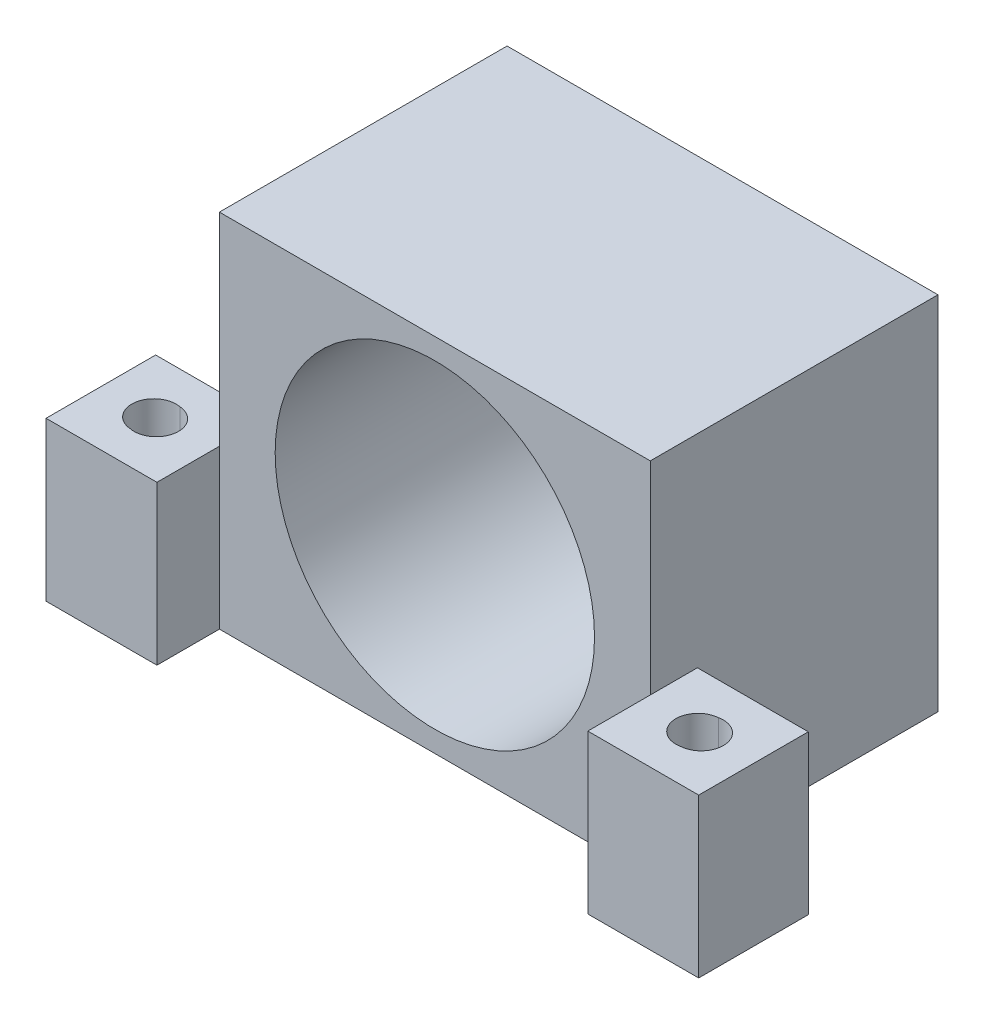
ISO-10303-21;
HEADER;
FILE_DESCRIPTION(('STEP AP214'),'2;1');
FILE_NAME('part.step','',(''),(''),'','','');
FILE_SCHEMA(('AUTOMOTIVE_DESIGN { 1 0 10303 214 1 1 1 1 }'));
ENDSEC;
DATA;
#1=APPLICATION_CONTEXT('core data for automotive mechanical design processes');
#2=APPLICATION_PROTOCOL_DEFINITION('international standard','automotive_design',2000,#1);
#3=PRODUCT_CONTEXT('',#1,'mechanical');
#4=PRODUCT('Part','Part','',(#3));
#5=PRODUCT_RELATED_PRODUCT_CATEGORY('part','',(#4));
#6=PRODUCT_DEFINITION_FORMATION('','',#4);
#7=PRODUCT_DEFINITION_CONTEXT('part definition',#1,'design');
#8=PRODUCT_DEFINITION('design','',#6,#7);
#9=PRODUCT_DEFINITION_SHAPE('','',#8);
#10=(LENGTH_UNIT() NAMED_UNIT(*) SI_UNIT(.MILLI.,.METRE.));
#11=(NAMED_UNIT(*) PLANE_ANGLE_UNIT() SI_UNIT($,.RADIAN.));
#12=(NAMED_UNIT(*) SI_UNIT($,.STERADIAN.) SOLID_ANGLE_UNIT());
#13=UNCERTAINTY_MEASURE_WITH_UNIT(LENGTH_MEASURE(1.E-05),#10,'distance_accuracy_value','');
#14=(GEOMETRIC_REPRESENTATION_CONTEXT(3) GLOBAL_UNCERTAINTY_ASSIGNED_CONTEXT((#13)) GLOBAL_UNIT_ASSIGNED_CONTEXT((#10,
#11,#12)) REPRESENTATION_CONTEXT('',''));
#15=CARTESIAN_POINT('',(0.,0.,0.));
#16=DIRECTION('',(0.,0.,1.));
#17=DIRECTION('',(1.,0.,0.));
#18=AXIS2_PLACEMENT_3D('',#15,#16,#17);
#19=CARTESIAN_POINT('',(21.375,-14.25,23.305));
#20=DIRECTION('',(0.,1.,0.));
#21=DIRECTION('',(-1.,0.,0.));
#22=AXIS2_PLACEMENT_3D('',#19,#20,#21);
#23=CYLINDRICAL_SURFACE('',#22,1.75);
#24=CARTESIAN_POINT('',(21.375,-11.075,23.305));
#25=DIRECTION('',(0.,-1.,0.));
#26=DIRECTION('',(1.,0.,0.));
#27=AXIS2_PLACEMENT_3D('',#24,#25,#26);
#28=CIRCLE('',#27,1.75);
#29=CARTESIAN_POINT('',(21.2411225701097,-11.075,21.5601284191191));
#30=VERTEX_POINT('',#29);
#31=CARTESIAN_POINT('',(21.7238774298904,-11.075,25.0198715808809));
#32=VERTEX_POINT('',#31);
#33=EDGE_CURVE('E175',#30,#32,#28,.F.);
#34=ORIENTED_EDGE('',*,*,#33,.F.);
#35=DIRECTION('',(0.,1.,0.));
#36=VECTOR('',#35,1.);
#37=CARTESIAN_POINT('',(21.2411225701097,-23.75,21.5601284191191));
#38=LINE('',#37,#36);
#39=CARTESIAN_POINT('',(21.2411225701097,-1.75,21.5601284191191));
#40=VERTEX_POINT('',#39);
#41=EDGE_CURVE('E55',#30,#40,#38,.T.);
#42=ORIENTED_EDGE('',*,*,#41,.T.);
#43=CARTESIAN_POINT('',(21.375,-1.75,23.305));
#44=DIRECTION('',(0.,1.,0.));
#45=DIRECTION('',(-1.,0.,0.));
#46=AXIS2_PLACEMENT_3D('',#43,#44,#45);
#47=CIRCLE('',#46,1.75);
#48=CARTESIAN_POINT('',(21.7238774298904,-1.75,25.0198715808809));
#49=VERTEX_POINT('',#48);
#50=EDGE_CURVE('E166',#40,#49,#47,.T.);
#51=ORIENTED_EDGE('',*,*,#50,.T.);
#52=DIRECTION('',(0.,1.,0.));
#53=VECTOR('',#52,1.);
#54=CARTESIAN_POINT('',(21.7238774298904,-23.75,25.0198715808809));
#55=LINE('',#54,#53);
#56=EDGE_CURVE('E343',#49,#32,#55,.F.);
#57=ORIENTED_EDGE('',*,*,#56,.T.);
#58=EDGE_LOOP('',(#34,#42,#51,#57));
#59=FACE_BOUND('',#58,.T.);
#60=ADVANCED_FACE('F33',(#59),#23,.F.);
#61=CARTESIAN_POINT('',(-21.375,-14.25,23.305));
#62=DIRECTION('',(0.,1.,0.));
#63=DIRECTION('',(-1.,0.,0.));
#64=AXIS2_PLACEMENT_3D('',#61,#62,#63);
#65=CYLINDRICAL_SURFACE('',#64,1.75);
#66=CARTESIAN_POINT('',(-21.375,-11.075,23.305));
#67=DIRECTION('',(0.,-1.,0.));
#68=DIRECTION('',(1.,0.,0.));
#69=AXIS2_PLACEMENT_3D('',#66,#67,#68);
#70=CIRCLE('',#69,1.75);
#71=CARTESIAN_POINT('',(-21.7238774298903,-11.075,25.019871580881));
#72=VERTEX_POINT('',#71);
#73=CARTESIAN_POINT('',(-21.2411225701095,-11.075,21.5601284191191));
#74=VERTEX_POINT('',#73);
#75=EDGE_CURVE('E158',#72,#74,#70,.F.);
#76=ORIENTED_EDGE('',*,*,#75,.F.);
#77=DIRECTION('',(0.,1.,0.));
#78=VECTOR('',#77,1.);
#79=CARTESIAN_POINT('',(-21.7238774298903,-23.75,25.019871580881));
#80=LINE('',#79,#78);
#81=CARTESIAN_POINT('',(-21.7238774298903,-1.75,25.019871580881));
#82=VERTEX_POINT('',#81);
#83=EDGE_CURVE('E47',#72,#82,#80,.T.);
#84=ORIENTED_EDGE('',*,*,#83,.T.);
#85=CARTESIAN_POINT('',(-21.375,-1.75,23.305));
#86=DIRECTION('',(0.,1.,0.));
#87=DIRECTION('',(-1.,0.,0.));
#88=AXIS2_PLACEMENT_3D('',#85,#86,#87);
#89=CIRCLE('',#88,1.75);
#90=CARTESIAN_POINT('',(-21.2411225701095,-1.75,21.5601284191191));
#91=VERTEX_POINT('',#90);
#92=EDGE_CURVE('E160',#82,#91,#89,.T.);
#93=ORIENTED_EDGE('',*,*,#92,.T.);
#94=DIRECTION('',(0.,1.,0.));
#95=VECTOR('',#94,1.);
#96=CARTESIAN_POINT('',(-21.2411225701095,-23.75,21.5601284191191));
#97=LINE('',#96,#95);
#98=EDGE_CURVE('E150',#91,#74,#97,.F.);
#99=ORIENTED_EDGE('',*,*,#98,.T.);
#100=EDGE_LOOP('',(#76,#84,#93,#99));
#101=FACE_BOUND('',#100,.T.);
#102=ADVANCED_FACE('F157',(#101),#65,.F.);
#103=CARTESIAN_POINT('',(17.,14.25,22.7));
#104=DIRECTION('',(-1.,0.,0.));
#105=DIRECTION('',(0.,0.,1.));
#106=AXIS2_PLACEMENT_3D('',#103,#104,#105);
#107=PLANE('',#106);
#108=DIRECTION('',(0.,0.,1.));
#109=VECTOR('',#108,1.);
#110=CARTESIAN_POINT('',(17.,-1.75,18.98));
#111=LINE('',#110,#109);
#112=CARTESIAN_POINT('',(17.,-1.75,18.98));
#113=VERTEX_POINT('',#112);
#114=CARTESIAN_POINT('',(17.,-1.75,22.7));
#115=VERTEX_POINT('',#114);
#116=EDGE_CURVE('E289',#113,#115,#111,.T.);
#117=ORIENTED_EDGE('',*,*,#116,.F.);
#118=DIRECTION('',(0.,-1.,0.));
#119=VECTOR('',#118,1.);
#120=CARTESIAN_POINT('',(17.,-1.75,18.98));
#121=LINE('',#120,#119);
#122=CARTESIAN_POINT('',(17.,-14.25,18.98));
#123=VERTEX_POINT('',#122);
#124=EDGE_CURVE('E308',#113,#123,#121,.T.);
#125=ORIENTED_EDGE('',*,*,#124,.T.);
#126=DIRECTION('',(0.,0.,-1.));
#127=VECTOR('',#126,1.);
#128=CARTESIAN_POINT('',(17.,-14.25,22.7));
#129=LINE('',#128,#127);
#130=CARTESIAN_POINT('',(17.,-14.25,0.));
#131=VERTEX_POINT('',#130);
#132=EDGE_CURVE('E194',#123,#131,#129,.T.);
#133=ORIENTED_EDGE('',*,*,#132,.T.);
#134=DIRECTION('',(0.,1.,0.));
#135=VECTOR('',#134,1.);
#136=CARTESIAN_POINT('',(17.,14.25,0.));
#137=LINE('',#136,#135);
#138=CARTESIAN_POINT('',(17.,14.25,0.));
#139=VERTEX_POINT('',#138);
#140=EDGE_CURVE('E214',#131,#139,#137,.T.);
#141=ORIENTED_EDGE('',*,*,#140,.T.);
#142=DIRECTION('',(0.,0.,-1.));
#143=VECTOR('',#142,1.);
#144=CARTESIAN_POINT('',(17.,14.25,22.7));
#145=LINE('',#144,#143);
#146=CARTESIAN_POINT('',(17.,14.25,22.7));
#147=VERTEX_POINT('',#146);
#148=EDGE_CURVE('E200',#147,#139,#145,.T.);
#149=ORIENTED_EDGE('',*,*,#148,.F.);
#150=DIRECTION('',(0.,1.,0.));
#151=VECTOR('',#150,1.);
#152=CARTESIAN_POINT('',(17.,14.25,22.7));
#153=LINE('',#152,#151);
#154=EDGE_CURVE('E226',#115,#147,#153,.T.);
#155=ORIENTED_EDGE('',*,*,#154,.F.);
#156=EDGE_LOOP('',(#117,#125,#133,#141,#149,#155));
#157=FACE_BOUND('',#156,.T.);
#158=ADVANCED_FACE('F391',(#157),#107,.F.);
#159=CARTESIAN_POINT('',(-17.,14.25,22.7));
#160=DIRECTION('',(1.,0.,0.));
#161=DIRECTION('',(0.,0.,-1.));
#162=AXIS2_PLACEMENT_3D('',#159,#160,#161);
#163=PLANE('',#162);
#164=DIRECTION('',(0.,1.,0.));
#165=VECTOR('',#164,1.);
#166=CARTESIAN_POINT('',(-17.,-1.75,18.98));
#167=LINE('',#166,#165);
#168=CARTESIAN_POINT('',(-17.,-14.25,18.98));
#169=VERTEX_POINT('',#168);
#170=CARTESIAN_POINT('',(-17.,-1.75,18.98));
#171=VERTEX_POINT('',#170);
#172=EDGE_CURVE('E274',#169,#171,#167,.T.);
#173=ORIENTED_EDGE('',*,*,#172,.T.);
#174=DIRECTION('',(0.,0.,1.));
#175=VECTOR('',#174,1.);
#176=CARTESIAN_POINT('',(-17.,-1.75,18.98));
#177=LINE('',#176,#175);
#178=CARTESIAN_POINT('',(-17.,-1.75,22.7));
#179=VERTEX_POINT('',#178);
#180=EDGE_CURVE('E257',#171,#179,#177,.T.);
#181=ORIENTED_EDGE('',*,*,#180,.T.);
#182=DIRECTION('',(0.,-1.,0.));
#183=VECTOR('',#182,1.);
#184=CARTESIAN_POINT('',(-17.,14.25,22.7));
#185=LINE('',#184,#183);
#186=CARTESIAN_POINT('',(-17.,14.25,22.7));
#187=VERTEX_POINT('',#186);
#188=EDGE_CURVE('E230',#187,#179,#185,.T.);
#189=ORIENTED_EDGE('',*,*,#188,.F.);
#190=DIRECTION('',(0.,0.,-1.));
#191=VECTOR('',#190,1.);
#192=CARTESIAN_POINT('',(-17.,14.25,22.7));
#193=LINE('',#192,#191);
#194=CARTESIAN_POINT('',(-17.,14.25,0.));
#195=VERTEX_POINT('',#194);
#196=EDGE_CURVE('E205',#187,#195,#193,.T.);
#197=ORIENTED_EDGE('',*,*,#196,.T.);
#198=DIRECTION('',(0.,-1.,0.));
#199=VECTOR('',#198,1.);
#200=CARTESIAN_POINT('',(-17.,14.25,0.));
#201=LINE('',#200,#199);
#202=CARTESIAN_POINT('',(-17.,-14.25,0.));
#203=VERTEX_POINT('',#202);
#204=EDGE_CURVE('E218',#195,#203,#201,.T.);
#205=ORIENTED_EDGE('',*,*,#204,.T.);
#206=DIRECTION('',(0.,0.,-1.));
#207=VECTOR('',#206,1.);
#208=CARTESIAN_POINT('',(-17.,-14.25,22.7));
#209=LINE('',#208,#207);
#210=EDGE_CURVE('E173',#169,#203,#209,.T.);
#211=ORIENTED_EDGE('',*,*,#210,.F.);
#212=EDGE_LOOP('',(#173,#181,#189,#197,#205,#211));
#213=FACE_BOUND('',#212,.T.);
#214=ADVANCED_FACE('F35',(#213),#163,.F.);
#215=CARTESIAN_POINT('',(17.,-14.25,22.7));
#216=DIRECTION('',(0.,1.,0.));
#217=DIRECTION('',(0.,0.,1.));
#218=AXIS2_PLACEMENT_3D('',#215,#216,#217);
#219=PLANE('',#218);
#220=CARTESIAN_POINT('',(21.375,-14.25,23.305));
#221=DIRECTION('',(0.,-1.,0.));
#222=DIRECTION('',(1.,0.,0.));
#223=AXIS2_PLACEMENT_3D('',#220,#221,#222);
#224=CIRCLE('',#223,3.25);
#225=CARTESIAN_POINT('',(24.625,-14.25,23.305));
#226=VERTEX_POINT('',#225);
#227=EDGE_CURVE('E182',#226,#226,#224,.T.);
#228=ORIENTED_EDGE('',*,*,#227,.F.);
#229=EDGE_LOOP('',(#228));
#230=FACE_BOUND('',#229,.T.);
#231=CARTESIAN_POINT('',(-21.375,-14.25,23.305));
#232=DIRECTION('',(0.,-1.,0.));
#233=DIRECTION('',(1.,0.,0.));
#234=AXIS2_PLACEMENT_3D('',#231,#232,#233);
#235=CIRCLE('',#234,3.25);
#236=CARTESIAN_POINT('',(-18.125,-14.25,23.305));
#237=VERTEX_POINT('',#236);
#238=EDGE_CURVE('E169',#237,#237,#235,.T.);
#239=ORIENTED_EDGE('',*,*,#238,.F.);
#240=EDGE_LOOP('',(#239));
#241=FACE_BOUND('',#240,.T.);
#242=DIRECTION('',(1.,0.,0.));
#243=VECTOR('',#242,1.);
#244=CARTESIAN_POINT('',(17.,-14.25,0.));
#245=LINE('',#244,#243);
#246=EDGE_CURVE('E216',#203,#131,#245,.T.);
#247=ORIENTED_EDGE('',*,*,#246,.T.);
#248=ORIENTED_EDGE('',*,*,#132,.F.);
#249=DIRECTION('',(1.,0.,0.));
#250=VECTOR('',#249,1.);
#251=CARTESIAN_POINT('',(17.,-14.25,18.98));
#252=LINE('',#251,#250);
#253=CARTESIAN_POINT('',(25.75,-14.25,18.98));
#254=VERTEX_POINT('',#253);
#255=EDGE_CURVE('E305',#123,#254,#252,.T.);
#256=ORIENTED_EDGE('',*,*,#255,.T.);
#257=DIRECTION('',(0.,0.,1.));
#258=VECTOR('',#257,1.);
#259=CARTESIAN_POINT('',(25.75,-14.25,18.98));
#260=LINE('',#259,#258);
#261=CARTESIAN_POINT('',(25.75,-14.25,27.63));
#262=VERTEX_POINT('',#261);
#263=EDGE_CURVE('E292',#254,#262,#260,.T.);
#264=ORIENTED_EDGE('',*,*,#263,.T.);
#265=DIRECTION('',(1.,0.,0.));
#266=VECTOR('',#265,1.);
#267=CARTESIAN_POINT('',(17.,-14.25,27.63));
#268=LINE('',#267,#266);
#269=CARTESIAN_POINT('',(17.,-14.25,27.63));
#270=VERTEX_POINT('',#269);
#271=EDGE_CURVE('E316',#270,#262,#268,.T.);
#272=ORIENTED_EDGE('',*,*,#271,.F.);
#273=DIRECTION('',(0.,0.,1.));
#274=VECTOR('',#273,1.);
#275=CARTESIAN_POINT('',(17.,-14.25,18.98));
#276=LINE('',#275,#274);
#277=CARTESIAN_POINT('',(17.,-14.25,22.7));
#278=VERTEX_POINT('',#277);
#279=EDGE_CURVE('E290',#278,#270,#276,.T.);
#280=ORIENTED_EDGE('',*,*,#279,.F.);
#281=DIRECTION('',(1.,0.,0.));
#282=VECTOR('',#281,1.);
#283=CARTESIAN_POINT('',(17.,-14.25,22.7));
#284=LINE('',#283,#282);
#285=CARTESIAN_POINT('',(-17.,-14.25,22.7));
#286=VERTEX_POINT('',#285);
#287=EDGE_CURVE('E227',#286,#278,#284,.T.);
#288=ORIENTED_EDGE('',*,*,#287,.F.);
#289=DIRECTION('',(0.,0.,1.));
#290=VECTOR('',#289,1.);
#291=CARTESIAN_POINT('',(-17.,-14.25,18.98));
#292=LINE('',#291,#290);
#293=CARTESIAN_POINT('',(-17.,-14.25,27.63));
#294=VERTEX_POINT('',#293);
#295=EDGE_CURVE('E252',#286,#294,#292,.T.);
#296=ORIENTED_EDGE('',*,*,#295,.T.);
#297=DIRECTION('',(1.,0.,0.));
#298=VECTOR('',#297,1.);
#299=CARTESIAN_POINT('',(-17.,-14.25,27.63));
#300=LINE('',#299,#298);
#301=CARTESIAN_POINT('',(-25.75,-14.25,27.63));
#302=VERTEX_POINT('',#301);
#303=EDGE_CURVE('E277',#302,#294,#300,.T.);
#304=ORIENTED_EDGE('',*,*,#303,.F.);
#305=DIRECTION('',(0.,0.,1.));
#306=VECTOR('',#305,1.);
#307=CARTESIAN_POINT('',(-25.75,-14.25,18.98));
#308=LINE('',#307,#306);
#309=CARTESIAN_POINT('',(-25.75,-14.25,18.98));
#310=VERTEX_POINT('',#309);
#311=EDGE_CURVE('E263',#310,#302,#308,.T.);
#312=ORIENTED_EDGE('',*,*,#311,.F.);
#313=DIRECTION('',(1.,0.,0.));
#314=VECTOR('',#313,1.);
#315=CARTESIAN_POINT('',(-17.,-14.25,18.98));
#316=LINE('',#315,#314);
#317=EDGE_CURVE('E266',#310,#169,#316,.T.);
#318=ORIENTED_EDGE('',*,*,#317,.T.);
#319=ORIENTED_EDGE('',*,*,#210,.T.);
#320=EDGE_LOOP('',(#247,#248,#256,#264,#272,#280,#288,#296,#304,#312,#318,#319));
#321=FACE_BOUND('',#320,.T.);
#322=ADVANCED_FACE('F365',(#230,#241,#321),#219,.F.);
#323=CARTESIAN_POINT('',(-17.,14.25,22.7));
#324=DIRECTION('',(0.,-1.,0.));
#325=DIRECTION('',(0.,0.,-1.));
#326=AXIS2_PLACEMENT_3D('',#323,#324,#325);
#327=PLANE('',#326);
#328=DIRECTION('',(-1.,0.,0.));
#329=VECTOR('',#328,1.);
#330=CARTESIAN_POINT('',(-17.,14.25,0.));
#331=LINE('',#330,#329);
#332=EDGE_CURVE('E211',#139,#195,#331,.T.);
#333=ORIENTED_EDGE('',*,*,#332,.T.);
#334=ORIENTED_EDGE('',*,*,#196,.F.);
#335=DIRECTION('',(-1.,0.,0.));
#336=VECTOR('',#335,1.);
#337=CARTESIAN_POINT('',(-17.,14.25,22.7));
#338=LINE('',#337,#336);
#339=EDGE_CURVE('E210',#147,#187,#338,.T.);
#340=ORIENTED_EDGE('',*,*,#339,.F.);
#341=ORIENTED_EDGE('',*,*,#148,.T.);
#342=EDGE_LOOP('',(#333,#334,#340,#341));
#343=FACE_BOUND('',#342,.T.);
#344=ADVANCED_FACE('F379',(#343),#327,.F.);
#345=CARTESIAN_POINT('',(0.,0.,22.7));
#346=DIRECTION('',(0.,0.,-1.));
#347=DIRECTION('',(-1.,0.,0.));
#348=AXIS2_PLACEMENT_3D('',#345,#346,#347);
#349=PLANE('',#348);
#350=CARTESIAN_POINT('',(0.,0.,22.7));
#351=DIRECTION('',(0.,0.,1.));
#352=DIRECTION('',(1.,0.,0.));
#353=AXIS2_PLACEMENT_3D('',#350,#351,#352);
#354=CIRCLE('',#353,12.6);
#355=CARTESIAN_POINT('',(12.6,0.,22.7));
#356=VERTEX_POINT('',#355);
#357=EDGE_CURVE('E233',#356,#356,#354,.T.);
#358=ORIENTED_EDGE('',*,*,#357,.F.);
#359=EDGE_LOOP('',(#358));
#360=FACE_BOUND('',#359,.T.);
#361=ORIENTED_EDGE('',*,*,#188,.T.);
#362=EDGE_CURVE('E213',#179,#286,#185,.T.);
#363=ORIENTED_EDGE('',*,*,#362,.T.);
#364=ORIENTED_EDGE('',*,*,#287,.T.);
#365=EDGE_CURVE('E223',#278,#115,#153,.T.);
#366=ORIENTED_EDGE('',*,*,#365,.T.);
#367=ORIENTED_EDGE('',*,*,#154,.T.);
#368=ORIENTED_EDGE('',*,*,#339,.T.);
#369=EDGE_LOOP('',(#361,#363,#364,#366,#367,#368));
#370=FACE_BOUND('',#369,.T.);
#371=ADVANCED_FACE('F373',(#360,#370),#349,.F.);
#372=CARTESIAN_POINT('',(0.,0.,0.));
#373=DIRECTION('',(0.,0.,-1.));
#374=DIRECTION('',(-1.,0.,0.));
#375=AXIS2_PLACEMENT_3D('',#372,#373,#374);
#376=PLANE('',#375);
#377=CARTESIAN_POINT('',(-6.01040764008568,6.01040764008562,0.));
#378=DIRECTION('',(0.,0.,-1.));
#379=DIRECTION('',(-1.,0.,0.));
#380=AXIS2_PLACEMENT_3D('',#377,#378,#379);
#381=CIRCLE('',#380,2.8);
#382=CARTESIAN_POINT('',(-8.81040764008569,6.01040764008562,0.));
#383=VERTEX_POINT('',#382);
#384=EDGE_CURVE('E188',#383,#383,#381,.T.);
#385=ORIENTED_EDGE('',*,*,#384,.F.);
#386=EDGE_LOOP('',(#385));
#387=FACE_BOUND('',#386,.T.);
#388=CARTESIAN_POINT('',(6.01040764008569,-6.01040764008562,0.));
#389=DIRECTION('',(0.,0.,-1.));
#390=DIRECTION('',(-1.,0.,0.));
#391=AXIS2_PLACEMENT_3D('',#388,#389,#390);
#392=CIRCLE('',#391,2.8);
#393=CARTESIAN_POINT('',(3.21040764008569,-6.01040764008562,0.));
#394=VERTEX_POINT('',#393);
#395=EDGE_CURVE('E335',#394,#394,#392,.T.);
#396=ORIENTED_EDGE('',*,*,#395,.F.);
#397=EDGE_LOOP('',(#396));
#398=FACE_BOUND('',#397,.T.);
#399=CARTESIAN_POINT('',(6.01040764008564,6.01040764008567,0.));
#400=DIRECTION('',(0.,0.,-1.));
#401=DIRECTION('',(-1.,0.,0.));
#402=AXIS2_PLACEMENT_3D('',#399,#400,#401);
#403=CIRCLE('',#402,2.8);
#404=CARTESIAN_POINT('',(3.21040764008564,6.01040764008567,0.));
#405=VERTEX_POINT('',#404);
#406=EDGE_CURVE('E332',#405,#405,#403,.T.);
#407=ORIENTED_EDGE('',*,*,#406,.F.);
#408=EDGE_LOOP('',(#407));
#409=FACE_BOUND('',#408,.T.);
#410=CARTESIAN_POINT('',(-6.01040764008564,-6.01040764008566,0.));
#411=DIRECTION('',(0.,0.,-1.));
#412=DIRECTION('',(-1.,0.,0.));
#413=AXIS2_PLACEMENT_3D('',#410,#411,#412);
#414=CIRCLE('',#413,2.8);
#415=CARTESIAN_POINT('',(-8.81040764008564,-6.01040764008566,0.));
#416=VERTEX_POINT('',#415);
#417=EDGE_CURVE('E183',#416,#416,#414,.T.);
#418=ORIENTED_EDGE('',*,*,#417,.F.);
#419=EDGE_LOOP('',(#418));
#420=FACE_BOUND('',#419,.T.);
#421=CARTESIAN_POINT('',(0.,0.,0.));
#422=DIRECTION('',(0.,0.,1.));
#423=DIRECTION('',(1.,0.,0.));
#424=AXIS2_PLACEMENT_3D('',#421,#422,#423);
#425=CIRCLE('',#424,3.75);
#426=CARTESIAN_POINT('',(3.75,0.,0.));
#427=VERTEX_POINT('',#426);
#428=EDGE_CURVE('E251',#427,#427,#425,.T.);
#429=ORIENTED_EDGE('',*,*,#428,.T.);
#430=EDGE_LOOP('',(#429));
#431=FACE_BOUND('',#430,.T.);
#432=ORIENTED_EDGE('',*,*,#204,.F.);
#433=ORIENTED_EDGE('',*,*,#332,.F.);
#434=ORIENTED_EDGE('',*,*,#140,.F.);
#435=ORIENTED_EDGE('',*,*,#246,.F.);
#436=EDGE_LOOP('',(#432,#433,#434,#435));
#437=FACE_BOUND('',#436,.T.);
#438=ADVANCED_FACE('F383',(#387,#398,#409,#420,#431,#437),#376,.T.);
#439=CARTESIAN_POINT('',(0.,0.,1.7));
#440=DIRECTION('',(0.,0.,1.));
#441=DIRECTION('',(1.,0.,0.));
#442=AXIS2_PLACEMENT_3D('',#439,#440,#441);
#443=CYLINDRICAL_SURFACE('',#442,12.6);
#444=CARTESIAN_POINT('',(0.,0.,1.7));
#445=DIRECTION('',(0.,0.,1.));
#446=DIRECTION('',(1.,0.,0.));
#447=AXIS2_PLACEMENT_3D('',#444,#445,#446);
#448=CIRCLE('',#447,12.6);
#449=CARTESIAN_POINT('',(12.6,0.,1.7));
#450=VERTEX_POINT('',#449);
#451=EDGE_CURVE('E221',#450,#450,#448,.T.);
#452=CARTESIAN_POINT('',(12.6,0.,1.7));
#453=CARTESIAN_POINT('',(12.6,0.,1.91875));
#454=CARTESIAN_POINT('',(12.6,0.,2.1375));
#455=CARTESIAN_POINT('',(12.6,0.,2.575));
#456=CARTESIAN_POINT('',(12.6,0.,2.79375));
#457=CARTESIAN_POINT('',(12.6,0.,3.23125));
#458=CARTESIAN_POINT('',(12.6,0.,3.45));
#459=CARTESIAN_POINT('',(12.6,0.,3.8875));
#460=CARTESIAN_POINT('',(12.6,0.,4.10625));
#461=CARTESIAN_POINT('',(12.6,0.,4.54375));
#462=CARTESIAN_POINT('',(12.6,0.,4.7625));
#463=CARTESIAN_POINT('',(12.6,0.,5.2));
#464=CARTESIAN_POINT('',(12.6,0.,5.41875));
#465=CARTESIAN_POINT('',(12.6,0.,5.85625));
#466=CARTESIAN_POINT('',(12.6,0.,6.075));
#467=CARTESIAN_POINT('',(12.6,0.,6.5125));
#468=CARTESIAN_POINT('',(12.6,0.,6.73125));
#469=CARTESIAN_POINT('',(12.6,0.,7.16875));
#470=CARTESIAN_POINT('',(12.6,0.,7.3875));
#471=CARTESIAN_POINT('',(12.6,0.,7.825));
#472=CARTESIAN_POINT('',(12.6,0.,8.04375));
#473=CARTESIAN_POINT('',(12.6,0.,8.48125));
#474=CARTESIAN_POINT('',(12.6,0.,8.7));
#475=CARTESIAN_POINT('',(12.6,0.,9.1375));
#476=CARTESIAN_POINT('',(12.6,0.,9.35625));
#477=CARTESIAN_POINT('',(12.6,0.,9.79375));
#478=CARTESIAN_POINT('',(12.6,0.,10.0125));
#479=CARTESIAN_POINT('',(12.6,0.,10.45));
#480=CARTESIAN_POINT('',(12.6,0.,10.66875));
#481=CARTESIAN_POINT('',(12.6,0.,11.10625));
#482=CARTESIAN_POINT('',(12.6,0.,11.325));
#483=CARTESIAN_POINT('',(12.6,0.,11.7625));
#484=CARTESIAN_POINT('',(12.6,0.,11.98125));
#485=CARTESIAN_POINT('',(12.6,0.,12.41875));
#486=CARTESIAN_POINT('',(12.6,0.,12.6375));
#487=CARTESIAN_POINT('',(12.6,0.,13.075));
#488=CARTESIAN_POINT('',(12.6,0.,13.29375));
#489=CARTESIAN_POINT('',(12.6,0.,13.73125));
#490=CARTESIAN_POINT('',(12.6,0.,13.95));
#491=CARTESIAN_POINT('',(12.6,0.,14.3875));
#492=CARTESIAN_POINT('',(12.6,0.,14.60625));
#493=CARTESIAN_POINT('',(12.6,0.,15.04375));
#494=CARTESIAN_POINT('',(12.6,0.,15.2625));
#495=CARTESIAN_POINT('',(12.6,0.,15.7));
#496=CARTESIAN_POINT('',(12.6,0.,15.91875));
#497=CARTESIAN_POINT('',(12.6,0.,16.35625));
#498=CARTESIAN_POINT('',(12.6,0.,16.575));
#499=CARTESIAN_POINT('',(12.6,0.,17.0125));
#500=CARTESIAN_POINT('',(12.6,0.,17.23125));
#501=CARTESIAN_POINT('',(12.6,0.,17.66875));
#502=CARTESIAN_POINT('',(12.6,0.,17.8875));
#503=CARTESIAN_POINT('',(12.6,0.,18.325));
#504=CARTESIAN_POINT('',(12.6,0.,18.54375));
#505=CARTESIAN_POINT('',(12.6,0.,18.98125));
#506=CARTESIAN_POINT('',(12.6,0.,19.2));
#507=CARTESIAN_POINT('',(12.6,0.,19.6375));
#508=CARTESIAN_POINT('',(12.6,0.,19.85625));
#509=CARTESIAN_POINT('',(12.6,0.,20.29375));
#510=CARTESIAN_POINT('',(12.6,0.,20.5125));
#511=CARTESIAN_POINT('',(12.6,0.,20.95));
#512=CARTESIAN_POINT('',(12.6,0.,21.16875));
#513=CARTESIAN_POINT('',(12.6,0.,21.60625));
#514=CARTESIAN_POINT('',(12.6,0.,21.825));
#515=CARTESIAN_POINT('',(12.6,0.,22.2625));
#516=CARTESIAN_POINT('',(12.6,0.,22.48125));
#517=CARTESIAN_POINT('',(12.6,0.,22.7));
#518=B_SPLINE_CURVE_WITH_KNOTS('',3,(#452,#453,#454,#455,#456,#457,#458,#459,#460,#461,#462,
#463,#464,#465,#466,#467,#468,#469,#470,#471,#472,#473,#474,#475,#476,#477,#478,#479,#480,#481,
#482,#483,#484,#485,#486,#487,#488,#489,#490,#491,#492,#493,#494,#495,#496,#497,#498,#499,#500,
#501,#502,#503,#504,#505,#506,#507,#508,#509,#510,#511,#512,#513,#514,#515,#516,#517),
.UNSPECIFIED.,.F.,.F.,(4,2,2,2,2,2,2,2,2,2,2,2,2,2,2,2,2,2,2,2,2,2,2,2,2,2,2,2,2,2,2,2,4),(0.,
0.65625,1.3125,1.96875,2.625,3.28125,3.9375,4.59375,5.25,5.90625,6.5625,7.21875,7.875,8.53125,
9.1875,9.84375,10.5,11.15625,11.8125,12.46875,13.125,13.78125,14.4375,15.09375,15.75,16.40625,
17.0625,17.71875,18.375,19.03125,19.6875,20.34375,21.),.UNSPECIFIED.);
#519=EDGE_CURVE('BSEAM628',#450,#356,#518,.T.);
#520=ORIENTED_EDGE('',*,*,#451,.F.);
#521=ORIENTED_EDGE('',*,*,#357,.T.);
#522=ORIENTED_EDGE('',*,*,#519,.T.);
#523=ORIENTED_EDGE('',*,*,#519,.F.);
#524=EDGE_LOOP('',(#520,#522,#521,#523));
#525=FACE_BOUND('',#524,.T.);
#526=ADVANCED_FACE('F628',(#525),#443,.F.);
#527=CARTESIAN_POINT('',(0.,0.,1.7));
#528=DIRECTION('',(0.,0.,1.));
#529=DIRECTION('',(1.,0.,0.));
#530=AXIS2_PLACEMENT_3D('',#527,#528,#529);
#531=PLANE('',#530);
#532=CARTESIAN_POINT('',(0.,0.,1.7));
#533=DIRECTION('',(0.,0.,1.));
#534=DIRECTION('',(1.,0.,0.));
#535=AXIS2_PLACEMENT_3D('',#532,#533,#534);
#536=CIRCLE('',#535,3.75);
#537=CARTESIAN_POINT('',(3.75,0.,1.7));
#538=VERTEX_POINT('',#537);
#539=EDGE_CURVE('E248',#538,#538,#536,.T.);
#540=ORIENTED_EDGE('',*,*,#539,.F.);
#541=EDGE_LOOP('',(#540));
#542=FACE_BOUND('',#541,.T.);
#543=CARTESIAN_POINT('',(-6.01040764008565,-6.01040764008566,1.7));
#544=DIRECTION('',(0.,0.,1.));
#545=DIRECTION('',(1.,0.,0.));
#546=AXIS2_PLACEMENT_3D('',#543,#544,#545);
#547=CIRCLE('',#546,1.625);
#548=CARTESIAN_POINT('',(-4.38540764008565,-6.01040764008566,1.7));
#549=VERTEX_POINT('',#548);
#550=EDGE_CURVE('E245',#549,#549,#547,.T.);
#551=ORIENTED_EDGE('',*,*,#550,.F.);
#552=EDGE_LOOP('',(#551));
#553=FACE_BOUND('',#552,.T.);
#554=CARTESIAN_POINT('',(6.01040764008566,-6.01040764008565,1.7));
#555=DIRECTION('',(0.,0.,1.));
#556=DIRECTION('',(1.,0.,0.));
#557=AXIS2_PLACEMENT_3D('',#554,#555,#556);
#558=CIRCLE('',#557,1.625);
#559=CARTESIAN_POINT('',(7.63540764008566,-6.01040764008565,1.7));
#560=VERTEX_POINT('',#559);
#561=EDGE_CURVE('E242',#560,#560,#558,.T.);
#562=ORIENTED_EDGE('',*,*,#561,.F.);
#563=EDGE_LOOP('',(#562));
#564=FACE_BOUND('',#563,.T.);
#565=CARTESIAN_POINT('',(-6.01040764008566,6.01040764008565,1.7));
#566=DIRECTION('',(0.,0.,1.));
#567=DIRECTION('',(1.,0.,0.));
#568=AXIS2_PLACEMENT_3D('',#565,#566,#567);
#569=CIRCLE('',#568,1.625);
#570=CARTESIAN_POINT('',(-4.38540764008566,6.01040764008565,1.7));
#571=VERTEX_POINT('',#570);
#572=EDGE_CURVE('E241',#571,#571,#569,.T.);
#573=ORIENTED_EDGE('',*,*,#572,.F.);
#574=EDGE_LOOP('',(#573));
#575=FACE_BOUND('',#574,.T.);
#576=CARTESIAN_POINT('',(6.01040764008565,6.01040764008566,1.7));
#577=DIRECTION('',(0.,0.,1.));
#578=DIRECTION('',(1.,0.,0.));
#579=AXIS2_PLACEMENT_3D('',#576,#577,#578);
#580=CIRCLE('',#579,1.625);
#581=CARTESIAN_POINT('',(7.63540764008565,6.01040764008566,1.7));
#582=VERTEX_POINT('',#581);
#583=EDGE_CURVE('E236',#582,#582,#580,.T.);
#584=ORIENTED_EDGE('',*,*,#583,.F.);
#585=EDGE_LOOP('',(#584));
#586=FACE_BOUND('',#585,.T.);
#587=ORIENTED_EDGE('',*,*,#451,.T.);
#588=EDGE_LOOP('',(#587));
#589=FACE_BOUND('',#588,.T.);
#590=ADVANCED_FACE('F636',(#542,#553,#564,#575,#586,#589),#531,.T.);
#591=CARTESIAN_POINT('',(6.01040764008565,6.01040764008566,0.));
#592=DIRECTION('',(0.,0.,1.));
#593=DIRECTION('',(1.,0.,0.));
#594=AXIS2_PLACEMENT_3D('',#591,#592,#593);
#595=CYLINDRICAL_SURFACE('',#594,1.625);
#596=CARTESIAN_POINT('',(6.01040764008564,6.01040764008567,1.175));
#597=DIRECTION('',(0.,0.,-1.));
#598=DIRECTION('',(-1.,0.,0.));
#599=AXIS2_PLACEMENT_3D('',#596,#597,#598);
#600=CIRCLE('',#599,1.625);
#601=CARTESIAN_POINT('',(4.38540764008564,6.01040764008567,1.175));
#602=VERTEX_POINT('',#601);
#603=EDGE_CURVE('E191',#602,#602,#600,.T.);
#604=ORIENTED_EDGE('',*,*,#603,.T.);
#605=EDGE_LOOP('',(#604));
#606=FACE_BOUND('',#605,.T.);
#607=ORIENTED_EDGE('',*,*,#583,.T.);
#608=EDGE_LOOP('',(#607));
#609=FACE_BOUND('',#608,.T.);
#610=ADVANCED_FACE('F644',(#606,#609),#595,.F.);
#611=CARTESIAN_POINT('',(-6.01040764008566,6.01040764008565,0.));
#612=DIRECTION('',(0.,0.,1.));
#613=DIRECTION('',(1.,0.,0.));
#614=AXIS2_PLACEMENT_3D('',#611,#612,#613);
#615=CYLINDRICAL_SURFACE('',#614,1.625);
#616=CARTESIAN_POINT('',(-6.01040764008568,6.01040764008562,1.175));
#617=DIRECTION('',(0.,0.,-1.));
#618=DIRECTION('',(-1.,0.,0.));
#619=AXIS2_PLACEMENT_3D('',#616,#617,#618);
#620=CIRCLE('',#619,1.625);
#621=CARTESIAN_POINT('',(-7.63540764008568,6.01040764008562,1.175));
#622=VERTEX_POINT('',#621);
#623=EDGE_CURVE('E187',#622,#622,#620,.T.);
#624=ORIENTED_EDGE('',*,*,#623,.T.);
#625=EDGE_LOOP('',(#624));
#626=FACE_BOUND('',#625,.T.);
#627=ORIENTED_EDGE('',*,*,#572,.T.);
#628=EDGE_LOOP('',(#627));
#629=FACE_BOUND('',#628,.T.);
#630=ADVANCED_FACE('F652',(#626,#629),#615,.F.);
#631=CARTESIAN_POINT('',(6.01040764008566,-6.01040764008565,0.));
#632=DIRECTION('',(0.,0.,1.));
#633=DIRECTION('',(1.,0.,0.));
#634=AXIS2_PLACEMENT_3D('',#631,#632,#633);
#635=CYLINDRICAL_SURFACE('',#634,1.625);
#636=CARTESIAN_POINT('',(6.01040764008569,-6.01040764008562,1.175));
#637=DIRECTION('',(0.,0.,-1.));
#638=DIRECTION('',(-1.,0.,0.));
#639=AXIS2_PLACEMENT_3D('',#636,#637,#638);
#640=CIRCLE('',#639,1.625);
#641=CARTESIAN_POINT('',(4.38540764008569,-6.01040764008562,1.175));
#642=VERTEX_POINT('',#641);
#643=EDGE_CURVE('E184',#642,#642,#640,.T.);
#644=ORIENTED_EDGE('',*,*,#643,.T.);
#645=EDGE_LOOP('',(#644));
#646=FACE_BOUND('',#645,.T.);
#647=ORIENTED_EDGE('',*,*,#561,.T.);
#648=EDGE_LOOP('',(#647));
#649=FACE_BOUND('',#648,.T.);
#650=ADVANCED_FACE('F660',(#646,#649),#635,.F.);
#651=CARTESIAN_POINT('',(-6.01040764008565,-6.01040764008566,0.));
#652=DIRECTION('',(0.,0.,1.));
#653=DIRECTION('',(1.,0.,0.));
#654=AXIS2_PLACEMENT_3D('',#651,#652,#653);
#655=CYLINDRICAL_SURFACE('',#654,1.625);
#656=CARTESIAN_POINT('',(-6.01040764008564,-6.01040764008566,1.175));
#657=DIRECTION('',(0.,0.,-1.));
#658=DIRECTION('',(-1.,0.,0.));
#659=AXIS2_PLACEMENT_3D('',#656,#657,#658);
#660=CIRCLE('',#659,1.625);
#661=CARTESIAN_POINT('',(-7.63540764008564,-6.01040764008566,1.175));
#662=VERTEX_POINT('',#661);
#663=EDGE_CURVE('E179',#662,#662,#660,.T.);
#664=ORIENTED_EDGE('',*,*,#663,.T.);
#665=EDGE_LOOP('',(#664));
#666=FACE_BOUND('',#665,.T.);
#667=ORIENTED_EDGE('',*,*,#550,.T.);
#668=EDGE_LOOP('',(#667));
#669=FACE_BOUND('',#668,.T.);
#670=ADVANCED_FACE('F668',(#666,#669),#655,.F.);
#671=CARTESIAN_POINT('',(0.,0.,0.));
#672=DIRECTION('',(0.,0.,1.));
#673=DIRECTION('',(1.,0.,0.));
#674=AXIS2_PLACEMENT_3D('',#671,#672,#673);
#675=CYLINDRICAL_SURFACE('',#674,3.75);
#676=ORIENTED_EDGE('',*,*,#428,.F.);
#677=EDGE_LOOP('',(#676));
#678=FACE_BOUND('',#677,.T.);
#679=ORIENTED_EDGE('',*,*,#539,.T.);
#680=EDGE_LOOP('',(#679));
#681=FACE_BOUND('',#680,.T.);
#682=ADVANCED_FACE('F593',(#678,#681),#675,.F.);
#683=CARTESIAN_POINT('',(-17.,-1.75,18.98));
#684=DIRECTION('',(1.,0.,0.));
#685=DIRECTION('',(0.,0.,-1.));
#686=AXIS2_PLACEMENT_3D('',#683,#684,#685);
#687=PLANE('',#686);
#688=ORIENTED_EDGE('',*,*,#362,.F.);
#689=CARTESIAN_POINT('',(-17.,-1.75,27.63));
#690=VERTEX_POINT('',#689);
#691=EDGE_CURVE('E261',#179,#690,#177,.T.);
#692=ORIENTED_EDGE('',*,*,#691,.T.);
#693=DIRECTION('',(0.,1.,0.));
#694=VECTOR('',#693,1.);
#695=CARTESIAN_POINT('',(-17.,-1.75,27.63));
#696=LINE('',#695,#694);
#697=EDGE_CURVE('E286',#294,#690,#696,.T.);
#698=ORIENTED_EDGE('',*,*,#697,.F.);
#699=ORIENTED_EDGE('',*,*,#295,.F.);
#700=EDGE_LOOP('',(#688,#692,#698,#699));
#701=FACE_BOUND('',#700,.T.);
#702=ADVANCED_FACE('F368',(#701),#687,.T.);
#703=CARTESIAN_POINT('',(-25.75,-1.75,18.98));
#704=DIRECTION('',(-1.,0.,0.));
#705=DIRECTION('',(0.,-1.,0.));
#706=AXIS2_PLACEMENT_3D('',#703,#704,#705);
#707=PLANE('',#706);
#708=ORIENTED_EDGE('',*,*,#311,.T.);
#709=DIRECTION('',(0.,-1.,0.));
#710=VECTOR('',#709,1.);
#711=CARTESIAN_POINT('',(-25.75,-1.75,27.63));
#712=LINE('',#711,#710);
#713=CARTESIAN_POINT('',(-25.75,-1.75,27.63));
#714=VERTEX_POINT('',#713);
#715=EDGE_CURVE('E280',#714,#302,#712,.T.);
#716=ORIENTED_EDGE('',*,*,#715,.F.);
#717=DIRECTION('',(0.,0.,1.));
#718=VECTOR('',#717,1.);
#719=CARTESIAN_POINT('',(-25.75,-1.75,18.98));
#720=LINE('',#719,#718);
#721=CARTESIAN_POINT('',(-25.75,-1.75,18.98));
#722=VERTEX_POINT('',#721);
#723=EDGE_CURVE('E260',#722,#714,#720,.T.);
#724=ORIENTED_EDGE('',*,*,#723,.F.);
#725=DIRECTION('',(0.,-1.,0.));
#726=VECTOR('',#725,1.);
#727=CARTESIAN_POINT('',(-25.75,-1.75,18.98));
#728=LINE('',#727,#726);
#729=EDGE_CURVE('E268',#722,#310,#728,.T.);
#730=ORIENTED_EDGE('',*,*,#729,.T.);
#731=EDGE_LOOP('',(#708,#716,#724,#730));
#732=FACE_BOUND('',#731,.T.);
#733=ADVANCED_FACE('F352',(#732),#707,.T.);
#734=CARTESIAN_POINT('',(-17.,-1.75,18.98));
#735=DIRECTION('',(0.,1.,0.));
#736=DIRECTION('',(-1.,0.,0.));
#737=AXIS2_PLACEMENT_3D('',#734,#735,#736);
#738=PLANE('',#737);
#739=CARTESIAN_POINT('',(-21.59,-1.75,23.275));
#740=DIRECTION('',(0.,1.,0.));
#741=DIRECTION('',(-1.,0.,0.));
#742=AXIS2_PLACEMENT_3D('',#739,#740,#741);
#743=CIRCLE('',#742,1.75000000000001);
#744=EDGE_CURVE('E345',#91,#82,#743,.T.);
#745=ORIENTED_EDGE('',*,*,#744,.F.);
#746=ORIENTED_EDGE('',*,*,#92,.F.);
#747=EDGE_LOOP('',(#745,#746));
#748=FACE_BOUND('',#747,.T.);
#749=ORIENTED_EDGE('',*,*,#723,.T.);
#750=DIRECTION('',(-1.,0.,0.));
#751=VECTOR('',#750,1.);
#752=CARTESIAN_POINT('',(-17.,-1.75,27.63));
#753=LINE('',#752,#751);
#754=EDGE_CURVE('E283',#690,#714,#753,.T.);
#755=ORIENTED_EDGE('',*,*,#754,.F.);
#756=ORIENTED_EDGE('',*,*,#691,.F.);
#757=ORIENTED_EDGE('',*,*,#180,.F.);
#758=DIRECTION('',(-1.,0.,0.));
#759=VECTOR('',#758,1.);
#760=CARTESIAN_POINT('',(-17.,-1.75,18.98));
#761=LINE('',#760,#759);
#762=EDGE_CURVE('E271',#171,#722,#761,.T.);
#763=ORIENTED_EDGE('',*,*,#762,.T.);
#764=EDGE_LOOP('',(#749,#755,#756,#757,#763));
#765=FACE_BOUND('',#764,.T.);
#766=ADVANCED_FACE('F348',(#748,#765),#738,.T.);
#767=CARTESIAN_POINT('',(0.,0.,18.98));
#768=DIRECTION('',(0.,0.,-1.));
#769=DIRECTION('',(-1.,0.,0.));
#770=AXIS2_PLACEMENT_3D('',#767,#768,#769);
#771=PLANE('',#770);
#772=ORIENTED_EDGE('',*,*,#172,.F.);
#773=ORIENTED_EDGE('',*,*,#317,.F.);
#774=ORIENTED_EDGE('',*,*,#729,.F.);
#775=ORIENTED_EDGE('',*,*,#762,.F.);
#776=EDGE_LOOP('',(#772,#773,#774,#775));
#777=FACE_BOUND('',#776,.T.);
#778=ADVANCED_FACE('F351',(#777),#771,.T.);
#779=CARTESIAN_POINT('',(0.,0.,27.63));
#780=DIRECTION('',(0.,0.,-1.));
#781=DIRECTION('',(-1.,0.,0.));
#782=AXIS2_PLACEMENT_3D('',#779,#780,#781);
#783=PLANE('',#782);
#784=ORIENTED_EDGE('',*,*,#697,.T.);
#785=ORIENTED_EDGE('',*,*,#754,.T.);
#786=ORIENTED_EDGE('',*,*,#715,.T.);
#787=ORIENTED_EDGE('',*,*,#303,.T.);
#788=EDGE_LOOP('',(#784,#785,#786,#787));
#789=FACE_BOUND('',#788,.T.);
#790=ADVANCED_FACE('F361',(#789),#783,.F.);
#791=CARTESIAN_POINT('',(17.,-1.75,18.98));
#792=DIRECTION('',(-1.,0.,0.));
#793=DIRECTION('',(0.,0.,1.));
#794=AXIS2_PLACEMENT_3D('',#791,#792,#793);
#795=PLANE('',#794);
#796=ORIENTED_EDGE('',*,*,#365,.F.);
#797=ORIENTED_EDGE('',*,*,#279,.T.);
#798=DIRECTION('',(0.,-1.,0.));
#799=VECTOR('',#798,1.);
#800=CARTESIAN_POINT('',(17.,-1.75,27.63));
#801=LINE('',#800,#799);
#802=CARTESIAN_POINT('',(17.,-1.75,27.63));
#803=VERTEX_POINT('',#802);
#804=EDGE_CURVE('E319',#803,#270,#801,.T.);
#805=ORIENTED_EDGE('',*,*,#804,.F.);
#806=EDGE_CURVE('E297',#115,#803,#111,.T.);
#807=ORIENTED_EDGE('',*,*,#806,.F.);
#808=EDGE_LOOP('',(#796,#797,#805,#807));
#809=FACE_BOUND('',#808,.T.);
#810=ADVANCED_FACE('F403',(#809),#795,.T.);
#811=CARTESIAN_POINT('',(17.,-1.75,18.98));
#812=DIRECTION('',(0.,1.,0.));
#813=DIRECTION('',(-1.,0.,0.));
#814=AXIS2_PLACEMENT_3D('',#811,#812,#813);
#815=PLANE('',#814);
#816=CARTESIAN_POINT('',(21.59,-1.74999999999999,23.275));
#817=DIRECTION('',(0.,1.,0.));
#818=DIRECTION('',(-1.,0.,0.));
#819=AXIS2_PLACEMENT_3D('',#816,#817,#818);
#820=CIRCLE('',#819,1.75);
#821=EDGE_CURVE('E336',#49,#40,#820,.T.);
#822=ORIENTED_EDGE('',*,*,#821,.F.);
#823=ORIENTED_EDGE('',*,*,#50,.F.);
#824=EDGE_LOOP('',(#822,#823));
#825=FACE_BOUND('',#824,.T.);
#826=ORIENTED_EDGE('',*,*,#116,.T.);
#827=ORIENTED_EDGE('',*,*,#806,.T.);
#828=DIRECTION('',(-1.,0.,0.));
#829=VECTOR('',#828,1.);
#830=CARTESIAN_POINT('',(17.,-1.75,27.63));
#831=LINE('',#830,#829);
#832=CARTESIAN_POINT('',(25.75,-1.75,27.63));
#833=VERTEX_POINT('',#832);
#834=EDGE_CURVE('E310',#833,#803,#831,.T.);
#835=ORIENTED_EDGE('',*,*,#834,.F.);
#836=DIRECTION('',(0.,0.,1.));
#837=VECTOR('',#836,1.);
#838=CARTESIAN_POINT('',(25.75,-1.75,18.98));
#839=LINE('',#838,#837);
#840=CARTESIAN_POINT('',(25.75,-1.75,18.98));
#841=VERTEX_POINT('',#840);
#842=EDGE_CURVE('E295',#841,#833,#839,.T.);
#843=ORIENTED_EDGE('',*,*,#842,.F.);
#844=DIRECTION('',(-1.,0.,0.));
#845=VECTOR('',#844,1.);
#846=CARTESIAN_POINT('',(17.,-1.75,18.98));
#847=LINE('',#846,#845);
#848=EDGE_CURVE('E293',#841,#113,#847,.T.);
#849=ORIENTED_EDGE('',*,*,#848,.T.);
#850=EDGE_LOOP('',(#826,#827,#835,#843,#849));
#851=FACE_BOUND('',#850,.T.);
#852=ADVANCED_FACE('F393',(#825,#851),#815,.T.);
#853=CARTESIAN_POINT('',(25.75,-1.75,18.98));
#854=DIRECTION('',(1.,0.,0.));
#855=DIRECTION('',(0.,1.,0.));
#856=AXIS2_PLACEMENT_3D('',#853,#854,#855);
#857=PLANE('',#856);
#858=ORIENTED_EDGE('',*,*,#842,.T.);
#859=DIRECTION('',(0.,1.,0.));
#860=VECTOR('',#859,1.);
#861=CARTESIAN_POINT('',(25.75,-1.75,27.63));
#862=LINE('',#861,#860);
#863=EDGE_CURVE('E313',#262,#833,#862,.T.);
#864=ORIENTED_EDGE('',*,*,#863,.F.);
#865=ORIENTED_EDGE('',*,*,#263,.F.);
#866=DIRECTION('',(0.,1.,0.));
#867=VECTOR('',#866,1.);
#868=CARTESIAN_POINT('',(25.75,-1.75,18.98));
#869=LINE('',#868,#867);
#870=EDGE_CURVE('E302',#254,#841,#869,.T.);
#871=ORIENTED_EDGE('',*,*,#870,.T.);
#872=EDGE_LOOP('',(#858,#864,#865,#871));
#873=FACE_BOUND('',#872,.T.);
#874=ADVANCED_FACE('F397',(#873),#857,.T.);
#875=CARTESIAN_POINT('',(0.,0.,18.98));
#876=DIRECTION('',(0.,0.,1.));
#877=DIRECTION('',(1.,0.,0.));
#878=AXIS2_PLACEMENT_3D('',#875,#876,#877);
#879=PLANE('',#878);
#880=ORIENTED_EDGE('',*,*,#124,.F.);
#881=ORIENTED_EDGE('',*,*,#848,.F.);
#882=ORIENTED_EDGE('',*,*,#870,.F.);
#883=ORIENTED_EDGE('',*,*,#255,.F.);
#884=EDGE_LOOP('',(#880,#881,#882,#883));
#885=FACE_BOUND('',#884,.T.);
#886=ADVANCED_FACE('F388',(#885),#879,.F.);
#887=CARTESIAN_POINT('',(0.,0.,27.63));
#888=DIRECTION('',(0.,0.,1.));
#889=DIRECTION('',(1.,0.,0.));
#890=AXIS2_PLACEMENT_3D('',#887,#888,#889);
#891=PLANE('',#890);
#892=ORIENTED_EDGE('',*,*,#804,.T.);
#893=ORIENTED_EDGE('',*,*,#271,.T.);
#894=ORIENTED_EDGE('',*,*,#863,.T.);
#895=ORIENTED_EDGE('',*,*,#834,.T.);
#896=EDGE_LOOP('',(#892,#893,#894,#895));
#897=FACE_BOUND('',#896,.T.);
#898=ADVANCED_FACE('F399',(#897),#891,.T.);
#899=CARTESIAN_POINT('',(-21.375,-11.075,23.305));
#900=DIRECTION('',(0.,-1.,0.));
#901=DIRECTION('',(1.,0.,0.));
#902=AXIS2_PLACEMENT_3D('',#899,#900,#901);
#903=PLANE('',#902);
#904=CARTESIAN_POINT('',(-21.59,-11.075,23.275));
#905=DIRECTION('',(0.,-1.,0.));
#906=DIRECTION('',(1.,0.,0.));
#907=AXIS2_PLACEMENT_3D('',#904,#905,#906);
#908=CIRCLE('',#907,1.75000000000001);
#909=EDGE_CURVE('E11',#72,#74,#908,.T.);
#910=ORIENTED_EDGE('',*,*,#909,.F.);
#911=ORIENTED_EDGE('',*,*,#75,.T.);
#912=EDGE_LOOP('',(#910,#911));
#913=FACE_BOUND('',#912,.T.);
#914=CARTESIAN_POINT('',(-21.375,-11.075,23.305));
#915=DIRECTION('',(0.,-1.,0.));
#916=DIRECTION('',(1.,0.,0.));
#917=AXIS2_PLACEMENT_3D('',#914,#915,#916);
#918=CIRCLE('',#917,3.25);
#919=CARTESIAN_POINT('',(-18.125,-11.075,23.305));
#920=VERTEX_POINT('',#919);
#921=EDGE_CURVE('E164',#920,#920,#918,.T.);
#922=ORIENTED_EDGE('',*,*,#921,.T.);
#923=EDGE_LOOP('',(#922));
#924=FACE_BOUND('',#923,.T.);
#925=ADVANCED_FACE('F162',(#913,#924),#903,.T.);
#926=CARTESIAN_POINT('',(-21.375,-11.075,23.305));
#927=DIRECTION('',(0.,-1.,0.));
#928=DIRECTION('',(1.,0.,0.));
#929=AXIS2_PLACEMENT_3D('',#926,#927,#928);
#930=CYLINDRICAL_SURFACE('',#929,3.25);
#931=ORIENTED_EDGE('',*,*,#921,.F.);
#932=EDGE_LOOP('',(#931));
#933=FACE_BOUND('',#932,.T.);
#934=ORIENTED_EDGE('',*,*,#238,.T.);
#935=EDGE_LOOP('',(#934));
#936=FACE_BOUND('',#935,.T.);
#937=ADVANCED_FACE('F447',(#933,#936),#930,.F.);
#938=CARTESIAN_POINT('',(21.375,-11.075,23.305));
#939=DIRECTION('',(0.,-1.,0.));
#940=DIRECTION('',(1.,0.,0.));
#941=AXIS2_PLACEMENT_3D('',#938,#939,#940);
#942=PLANE('',#941);
#943=CARTESIAN_POINT('',(21.59,-11.075,23.275));
#944=DIRECTION('',(0.,-1.,0.));
#945=DIRECTION('',(1.,0.,0.));
#946=AXIS2_PLACEMENT_3D('',#943,#944,#945);
#947=CIRCLE('',#946,1.75);
#948=EDGE_CURVE('E41',#30,#32,#947,.T.);
#949=ORIENTED_EDGE('',*,*,#948,.F.);
#950=ORIENTED_EDGE('',*,*,#33,.T.);
#951=EDGE_LOOP('',(#949,#950));
#952=FACE_BOUND('',#951,.T.);
#953=CARTESIAN_POINT('',(21.375,-11.075,23.305));
#954=DIRECTION('',(0.,-1.,0.));
#955=DIRECTION('',(1.,0.,0.));
#956=AXIS2_PLACEMENT_3D('',#953,#954,#955);
#957=CIRCLE('',#956,3.25);
#958=CARTESIAN_POINT('',(24.625,-11.075,23.305));
#959=VERTEX_POINT('',#958);
#960=EDGE_CURVE('E178',#959,#959,#957,.T.);
#961=ORIENTED_EDGE('',*,*,#960,.T.);
#962=EDGE_LOOP('',(#961));
#963=FACE_BOUND('',#962,.T.);
#964=ADVANCED_FACE('F455',(#952,#963),#942,.T.);
#965=CARTESIAN_POINT('',(21.375,-11.075,23.305));
#966=DIRECTION('',(0.,-1.,0.));
#967=DIRECTION('',(1.,0.,0.));
#968=AXIS2_PLACEMENT_3D('',#965,#966,#967);
#969=CYLINDRICAL_SURFACE('',#968,3.25);
#970=ORIENTED_EDGE('',*,*,#960,.F.);
#971=EDGE_LOOP('',(#970));
#972=FACE_BOUND('',#971,.T.);
#973=ORIENTED_EDGE('',*,*,#227,.T.);
#974=EDGE_LOOP('',(#973));
#975=FACE_BOUND('',#974,.T.);
#976=ADVANCED_FACE('F462',(#972,#975),#969,.F.);
#977=CARTESIAN_POINT('',(-6.01040764008564,-6.01040764008566,0.));
#978=DIRECTION('',(0.,0.,-1.));
#979=DIRECTION('',(-1.,0.,0.));
#980=AXIS2_PLACEMENT_3D('',#977,#978,#979);
#981=CONICAL_SURFACE('',#980,2.8,0.78539816339745);
#982=ORIENTED_EDGE('',*,*,#417,.T.);
#983=EDGE_LOOP('',(#982));
#984=FACE_BOUND('',#983,.T.);
#985=ORIENTED_EDGE('',*,*,#663,.F.);
#986=EDGE_LOOP('',(#985));
#987=FACE_BOUND('',#986,.T.);
#988=ADVANCED_FACE('F470',(#984,#987),#981,.F.);
#989=CARTESIAN_POINT('',(6.01040764008569,-6.01040764008562,0.));
#990=DIRECTION('',(0.,0.,-1.));
#991=DIRECTION('',(-1.,0.,0.));
#992=AXIS2_PLACEMENT_3D('',#989,#990,#991);
#993=CONICAL_SURFACE('',#992,2.8,0.78539816339745);
#994=ORIENTED_EDGE('',*,*,#395,.T.);
#995=EDGE_LOOP('',(#994));
#996=FACE_BOUND('',#995,.T.);
#997=ORIENTED_EDGE('',*,*,#643,.F.);
#998=EDGE_LOOP('',(#997));
#999=FACE_BOUND('',#998,.T.);
#1000=ADVANCED_FACE('F479',(#996,#999),#993,.F.);
#1001=CARTESIAN_POINT('',(-6.01040764008568,6.01040764008562,0.));
#1002=DIRECTION('',(0.,0.,-1.));
#1003=DIRECTION('',(-1.,0.,0.));
#1004=AXIS2_PLACEMENT_3D('',#1001,#1002,#1003);
#1005=CONICAL_SURFACE('',#1004,2.8,0.78539816339745);
#1006=ORIENTED_EDGE('',*,*,#384,.T.);
#1007=EDGE_LOOP('',(#1006));
#1008=FACE_BOUND('',#1007,.T.);
#1009=ORIENTED_EDGE('',*,*,#623,.F.);
#1010=EDGE_LOOP('',(#1009));
#1011=FACE_BOUND('',#1010,.T.);
#1012=ADVANCED_FACE('F488',(#1008,#1011),#1005,.F.);
#1013=CARTESIAN_POINT('',(6.01040764008564,6.01040764008567,0.));
#1014=DIRECTION('',(0.,0.,-1.));
#1015=DIRECTION('',(-1.,0.,0.));
#1016=AXIS2_PLACEMENT_3D('',#1013,#1014,#1015);
#1017=CONICAL_SURFACE('',#1016,2.8,0.78539816339745);
#1018=ORIENTED_EDGE('',*,*,#406,.T.);
#1019=EDGE_LOOP('',(#1018));
#1020=FACE_BOUND('',#1019,.T.);
#1021=ORIENTED_EDGE('',*,*,#603,.F.);
#1022=EDGE_LOOP('',(#1021));
#1023=FACE_BOUND('',#1022,.T.);
#1024=ADVANCED_FACE('F496',(#1020,#1023),#1017,.F.);
#1025=CARTESIAN_POINT('',(21.59,-48.75,23.275));
#1026=DIRECTION('',(0.,1.,0.));
#1027=DIRECTION('',(0.,0.,1.));
#1028=AXIS2_PLACEMENT_3D('',#1025,#1026,#1027);
#1029=CYLINDRICAL_SURFACE('',#1028,1.75);
#1030=ORIENTED_EDGE('',*,*,#821,.T.);
#1031=ORIENTED_EDGE('',*,*,#41,.F.);
#1032=ORIENTED_EDGE('',*,*,#948,.T.);
#1033=ORIENTED_EDGE('',*,*,#56,.F.);
#1034=EDGE_LOOP('',(#1030,#1031,#1032,#1033));
#1035=FACE_BOUND('',#1034,.T.);
#1036=ADVANCED_FACE('F504',(#1035),#1029,.F.);
#1037=CARTESIAN_POINT('',(-21.59,-48.75,23.275));
#1038=DIRECTION('',(0.,1.,0.));
#1039=DIRECTION('',(0.,0.,1.));
#1040=AXIS2_PLACEMENT_3D('',#1037,#1038,#1039);
#1041=CYLINDRICAL_SURFACE('',#1040,1.75000000000001);
#1042=ORIENTED_EDGE('',*,*,#744,.T.);
#1043=ORIENTED_EDGE('',*,*,#83,.F.);
#1044=ORIENTED_EDGE('',*,*,#909,.T.);
#1045=ORIENTED_EDGE('',*,*,#98,.F.);
#1046=EDGE_LOOP('',(#1042,#1043,#1044,#1045));
#1047=FACE_BOUND('',#1046,.T.);
#1048=ADVANCED_FACE('F149',(#1047),#1041,.F.);
#1049=CLOSED_SHELL('',(#60,#102,#158,#214,#322,#344,#371,#438,#526,#590,#610,#630,#650,#670,
#682,#702,#733,#766,#778,#790,#810,#852,#874,#886,#898,#925,#937,#964,#976,#988,#1000,#1012,
#1024,#1036,#1048));
#1050=MANIFOLD_SOLID_BREP('B2',#1049);
#1051=ADVANCED_BREP_SHAPE_REPRESENTATION('',(#18,#1050),#14);
#1052=SHAPE_DEFINITION_REPRESENTATION(#9,#1051);
ENDSEC;
END-ISO-10303-21;
